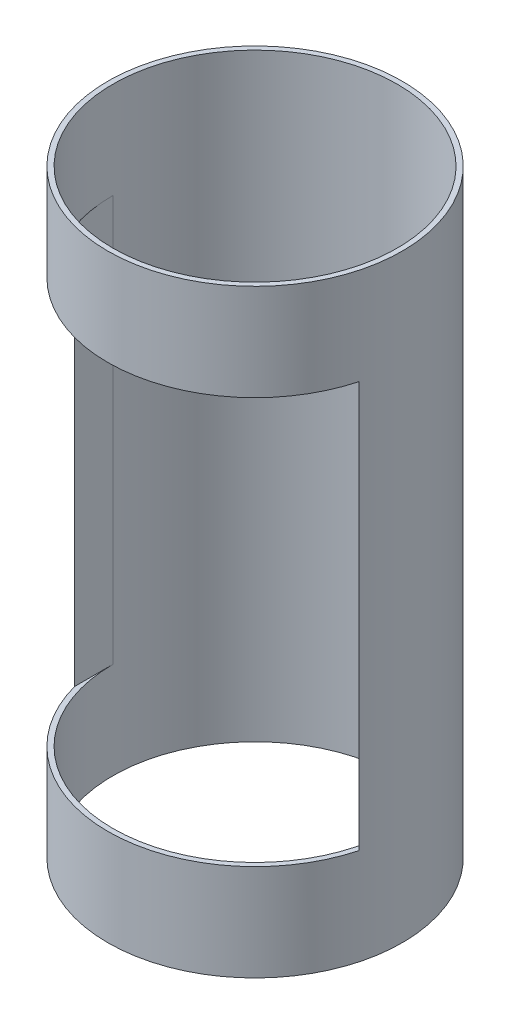
ISO-10303-21;
HEADER;
FILE_DESCRIPTION(('STEP AP214'),'2;1');
FILE_NAME('part.step','',(''),(''),'','','');
FILE_SCHEMA(('AUTOMOTIVE_DESIGN { 1 0 10303 214 1 1 1 1 }'));
ENDSEC;
DATA;
#1=APPLICATION_CONTEXT('core data for automotive mechanical design processes');
#2=APPLICATION_PROTOCOL_DEFINITION('international standard','automotive_design',2000,#1);
#3=PRODUCT_CONTEXT('',#1,'mechanical');
#4=PRODUCT('Part','Part','',(#3));
#5=PRODUCT_RELATED_PRODUCT_CATEGORY('part','',(#4));
#6=PRODUCT_DEFINITION_FORMATION('','',#4);
#7=PRODUCT_DEFINITION_CONTEXT('part definition',#1,'design');
#8=PRODUCT_DEFINITION('design','',#6,#7);
#9=PRODUCT_DEFINITION_SHAPE('','',#8);
#10=(LENGTH_UNIT() NAMED_UNIT(*) SI_UNIT(.MILLI.,.METRE.));
#11=(NAMED_UNIT(*) PLANE_ANGLE_UNIT() SI_UNIT($,.RADIAN.));
#12=(NAMED_UNIT(*) SI_UNIT($,.STERADIAN.) SOLID_ANGLE_UNIT());
#13=UNCERTAINTY_MEASURE_WITH_UNIT(LENGTH_MEASURE(1.E-05),#10,'distance_accuracy_value','');
#14=(GEOMETRIC_REPRESENTATION_CONTEXT(3) GLOBAL_UNCERTAINTY_ASSIGNED_CONTEXT((#13)) GLOBAL_UNIT_ASSIGNED_CONTEXT((#10,
#11,#12)) REPRESENTATION_CONTEXT('',''));
#15=CARTESIAN_POINT('',(0.,0.,0.));
#16=DIRECTION('',(0.,0.,1.));
#17=DIRECTION('',(1.,0.,0.));
#18=AXIS2_PLACEMENT_3D('',#15,#16,#17);
#19=CARTESIAN_POINT('',(0.,374.65,0.));
#20=DIRECTION('',(0.,-1.,0.));
#21=DIRECTION('',(0.,0.,-1.));
#22=AXIS2_PLACEMENT_3D('',#19,#20,#21);
#23=CYLINDRICAL_SURFACE('',#22,92.0749999999999);
#24=CARTESIAN_POINT('',(0.,374.65,0.));
#25=DIRECTION('',(0.,1.,0.));
#26=DIRECTION('',(0.,0.,1.));
#27=AXIS2_PLACEMENT_3D('',#24,#25,#26);
#28=CIRCLE('',#27,92.0749999999999);
#29=CARTESIAN_POINT('',(0.,374.65,92.0749999999999));
#30=VERTEX_POINT('',#29);
#31=EDGE_CURVE('E113',#30,#30,#28,.T.);
#32=ORIENTED_EDGE('',*,*,#31,.F.);
#33=EDGE_LOOP('',(#32));
#34=FACE_BOUND('',#33,.T.);
#35=CARTESIAN_POINT('',(0.,0.,0.));
#36=DIRECTION('',(0.,1.,0.));
#37=DIRECTION('',(0.,0.,1.));
#38=AXIS2_PLACEMENT_3D('',#35,#36,#37);
#39=CIRCLE('',#38,92.0749999999999);
#40=CARTESIAN_POINT('',(0.,0.,92.0749999999999));
#41=VERTEX_POINT('',#40);
#42=EDGE_CURVE('E110',#41,#41,#39,.T.);
#43=ORIENTED_EDGE('',*,*,#42,.T.);
#44=EDGE_LOOP('',(#43));
#45=FACE_BOUND('',#44,.T.);
#46=CARTESIAN_POINT('',(0.,60.325,0.));
#47=DIRECTION('',(0.,1.,0.));
#48=DIRECTION('',(0.,0.,1.));
#49=AXIS2_PLACEMENT_3D('',#46,#47,#48);
#50=CIRCLE('',#49,92.0749999999999);
#51=CARTESIAN_POINT('',(-88.9,60.325,23.9707243319842));
#52=VERTEX_POINT('',#51);
#53=CARTESIAN_POINT('',(88.9,60.325,23.9707243319844));
#54=VERTEX_POINT('',#53);
#55=EDGE_CURVE('E47',#52,#54,#50,.T.);
#56=ORIENTED_EDGE('',*,*,#55,.F.);
#57=DIRECTION('',(0.,-1.,0.));
#58=VECTOR('',#57,1.);
#59=CARTESIAN_POINT('',(-88.9,374.65,23.9707243319842));
#60=LINE('',#59,#58);
#61=CARTESIAN_POINT('',(-88.9,314.325,23.9707243319842));
#62=VERTEX_POINT('',#61);
#63=EDGE_CURVE('E101',#62,#52,#60,.T.);
#64=ORIENTED_EDGE('',*,*,#63,.F.);
#65=CARTESIAN_POINT('',(0.,314.325,0.));
#66=DIRECTION('',(0.,-1.,0.));
#67=DIRECTION('',(0.,0.,-1.));
#68=AXIS2_PLACEMENT_3D('',#65,#66,#67);
#69=CIRCLE('',#68,92.0749999999999);
#70=CARTESIAN_POINT('',(88.9,314.325,23.9707243319844));
#71=VERTEX_POINT('',#70);
#72=EDGE_CURVE('E103',#71,#62,#69,.T.);
#73=ORIENTED_EDGE('',*,*,#72,.F.);
#74=DIRECTION('',(0.,-1.,0.));
#75=VECTOR('',#74,1.);
#76=CARTESIAN_POINT('',(88.9,374.65,23.9707243319844));
#77=LINE('',#76,#75);
#78=EDGE_CURVE('E89',#54,#71,#77,.F.);
#79=ORIENTED_EDGE('',*,*,#78,.F.);
#80=EDGE_LOOP('',(#56,#64,#73,#79));
#81=FACE_BOUND('',#80,.T.);
#82=ADVANCED_FACE('F33',(#34,#45,#81),#23,.T.);
#83=CARTESIAN_POINT('',(0.,374.65,0.));
#84=DIRECTION('',(0.,-1.,0.));
#85=DIRECTION('',(0.,0.,-1.));
#86=AXIS2_PLACEMENT_3D('',#83,#84,#85);
#87=CYLINDRICAL_SURFACE('',#86,88.9000000000002);
#88=CARTESIAN_POINT('',(0.,374.65,0.));
#89=DIRECTION('',(0.,1.,0.));
#90=DIRECTION('',(0.,0.,1.));
#91=AXIS2_PLACEMENT_3D('',#88,#89,#90);
#92=CIRCLE('',#91,88.9000000000002);
#93=CARTESIAN_POINT('',(0.,374.65,88.9000000000002));
#94=VERTEX_POINT('',#93);
#95=EDGE_CURVE('E107',#94,#94,#92,.T.);
#96=ORIENTED_EDGE('',*,*,#95,.T.);
#97=EDGE_LOOP('',(#96));
#98=FACE_BOUND('',#97,.T.);
#99=CARTESIAN_POINT('',(0.,0.,0.));
#100=DIRECTION('',(0.,1.,0.));
#101=DIRECTION('',(0.,0.,1.));
#102=AXIS2_PLACEMENT_3D('',#99,#100,#101);
#103=CIRCLE('',#102,88.9000000000002);
#104=CARTESIAN_POINT('',(0.,0.,88.9000000000002));
#105=VERTEX_POINT('',#104);
#106=EDGE_CURVE('E106',#105,#105,#103,.T.);
#107=ORIENTED_EDGE('',*,*,#106,.F.);
#108=EDGE_LOOP('',(#107));
#109=FACE_BOUND('',#108,.T.);
#110=DIRECTION('',(0.,1.,0.));
#111=VECTOR('',#110,1.);
#112=CARTESIAN_POINT('',(88.9,60.325,0.));
#113=LINE('',#112,#111);
#114=CARTESIAN_POINT('',(88.9,60.325,0.));
#115=VERTEX_POINT('',#114);
#116=CARTESIAN_POINT('',(88.9,314.325,0.));
#117=VERTEX_POINT('',#116);
#118=EDGE_CURVE('E87',#115,#117,#113,.T.);
#119=ORIENTED_EDGE('',*,*,#118,.T.);
#120=CARTESIAN_POINT('',(0.,314.325,0.));
#121=DIRECTION('',(0.,-1.,0.));
#122=DIRECTION('',(0.,0.,-1.));
#123=AXIS2_PLACEMENT_3D('',#120,#121,#122);
#124=CIRCLE('',#123,88.9000000000002);
#125=CARTESIAN_POINT('',(-88.9,314.325,0.));
#126=VERTEX_POINT('',#125);
#127=EDGE_CURVE('E11',#117,#126,#124,.T.);
#128=ORIENTED_EDGE('',*,*,#127,.T.);
#129=DIRECTION('',(0.,-1.,0.));
#130=VECTOR('',#129,1.);
#131=CARTESIAN_POINT('',(-88.9,60.325,0.));
#132=LINE('',#131,#130);
#133=CARTESIAN_POINT('',(-88.9000000000002,60.325,0.));
#134=VERTEX_POINT('',#133);
#135=EDGE_CURVE('E92',#126,#134,#132,.T.);
#136=ORIENTED_EDGE('',*,*,#135,.T.);
#137=CARTESIAN_POINT('',(0.,60.325,0.));
#138=DIRECTION('',(0.,1.,0.));
#139=DIRECTION('',(0.,0.,1.));
#140=AXIS2_PLACEMENT_3D('',#137,#138,#139);
#141=CIRCLE('',#140,88.9000000000002);
#142=EDGE_CURVE('E40',#134,#115,#141,.T.);
#143=ORIENTED_EDGE('',*,*,#142,.T.);
#144=EDGE_LOOP('',(#119,#128,#136,#143));
#145=FACE_BOUND('',#144,.T.);
#146=ADVANCED_FACE('F91',(#98,#109,#145),#87,.F.);
#147=CARTESIAN_POINT('',(0.,374.65,0.));
#148=DIRECTION('',(0.,1.,0.));
#149=DIRECTION('',(0.,0.,1.));
#150=AXIS2_PLACEMENT_3D('',#147,#148,#149);
#151=PLANE('',#150);
#152=ORIENTED_EDGE('',*,*,#31,.T.);
#153=EDGE_LOOP('',(#152));
#154=FACE_BOUND('',#153,.T.);
#155=ORIENTED_EDGE('',*,*,#95,.F.);
#156=EDGE_LOOP('',(#155));
#157=FACE_BOUND('',#156,.T.);
#158=ADVANCED_FACE('F123',(#154,#157),#151,.T.);
#159=CARTESIAN_POINT('',(0.,0.,0.));
#160=DIRECTION('',(0.,1.,0.));
#161=DIRECTION('',(0.,0.,1.));
#162=AXIS2_PLACEMENT_3D('',#159,#160,#161);
#163=PLANE('',#162);
#164=ORIENTED_EDGE('',*,*,#42,.F.);
#165=EDGE_LOOP('',(#164));
#166=FACE_BOUND('',#165,.T.);
#167=ORIENTED_EDGE('',*,*,#106,.T.);
#168=EDGE_LOOP('',(#167));
#169=FACE_BOUND('',#168,.T.);
#170=ADVANCED_FACE('F120',(#166,#169),#163,.F.);
#171=CARTESIAN_POINT('',(88.9,60.325,92.0749999999999));
#172=DIRECTION('',(-1.,0.,0.));
#173=DIRECTION('',(0.,0.,1.));
#174=AXIS2_PLACEMENT_3D('',#171,#172,#173);
#175=PLANE('',#174);
#176=ORIENTED_EDGE('',*,*,#78,.T.);
#177=DIRECTION('',(0.,0.,-1.));
#178=VECTOR('',#177,1.);
#179=CARTESIAN_POINT('',(88.9,314.325,92.0749999999999));
#180=LINE('',#179,#178);
#181=EDGE_CURVE('E76',#71,#117,#180,.T.);
#182=ORIENTED_EDGE('',*,*,#181,.T.);
#183=ORIENTED_EDGE('',*,*,#118,.F.);
#184=DIRECTION('',(0.,0.,-1.));
#185=VECTOR('',#184,1.);
#186=CARTESIAN_POINT('',(88.9,60.325,92.0749999999999));
#187=LINE('',#186,#185);
#188=EDGE_CURVE('E94',#54,#115,#187,.T.);
#189=ORIENTED_EDGE('',*,*,#188,.F.);
#190=EDGE_LOOP('',(#176,#182,#183,#189));
#191=FACE_BOUND('',#190,.T.);
#192=ADVANCED_FACE('F85',(#191),#175,.T.);
#193=CARTESIAN_POINT('',(-88.9,314.325,92.0749999999999));
#194=DIRECTION('',(0.,-1.,0.));
#195=DIRECTION('',(0.,0.,-1.));
#196=AXIS2_PLACEMENT_3D('',#193,#194,#195);
#197=PLANE('',#196);
#198=ORIENTED_EDGE('',*,*,#72,.T.);
#199=DIRECTION('',(0.,0.,-1.));
#200=VECTOR('',#199,1.);
#201=CARTESIAN_POINT('',(-88.9,314.325,92.0749999999999));
#202=LINE('',#201,#200);
#203=EDGE_CURVE('E79',#62,#126,#202,.T.);
#204=ORIENTED_EDGE('',*,*,#203,.T.);
#205=ORIENTED_EDGE('',*,*,#127,.F.);
#206=ORIENTED_EDGE('',*,*,#181,.F.);
#207=EDGE_LOOP('',(#198,#204,#205,#206));
#208=FACE_BOUND('',#207,.T.);
#209=ADVANCED_FACE('F75',(#208),#197,.T.);
#210=CARTESIAN_POINT('',(-88.9,60.325,92.0749999999999));
#211=DIRECTION('',(1.,0.,0.));
#212=DIRECTION('',(0.,0.,-1.));
#213=AXIS2_PLACEMENT_3D('',#210,#211,#212);
#214=PLANE('',#213);
#215=ORIENTED_EDGE('',*,*,#63,.T.);
#216=DIRECTION('',(0.,0.,-1.));
#217=VECTOR('',#216,1.);
#218=CARTESIAN_POINT('',(-88.9,60.325,92.0749999999999));
#219=LINE('',#218,#217);
#220=EDGE_CURVE('E54',#52,#134,#219,.T.);
#221=ORIENTED_EDGE('',*,*,#220,.T.);
#222=ORIENTED_EDGE('',*,*,#135,.F.);
#223=ORIENTED_EDGE('',*,*,#203,.F.);
#224=EDGE_LOOP('',(#215,#221,#222,#223));
#225=FACE_BOUND('',#224,.T.);
#226=ADVANCED_FACE('F141',(#225),#214,.T.);
#227=CARTESIAN_POINT('',(-88.9,60.325,92.0749999999999));
#228=DIRECTION('',(0.,1.,0.));
#229=DIRECTION('',(0.,0.,1.));
#230=AXIS2_PLACEMENT_3D('',#227,#228,#229);
#231=PLANE('',#230);
#232=ORIENTED_EDGE('',*,*,#55,.T.);
#233=ORIENTED_EDGE('',*,*,#188,.T.);
#234=ORIENTED_EDGE('',*,*,#142,.F.);
#235=ORIENTED_EDGE('',*,*,#220,.F.);
#236=EDGE_LOOP('',(#232,#233,#234,#235));
#237=FACE_BOUND('',#236,.T.);
#238=ADVANCED_FACE('F144',(#237),#231,.T.);
#239=CLOSED_SHELL('',(#82,#146,#158,#170,#192,#209,#226,#238));
#240=MANIFOLD_SOLID_BREP('B2',#239);
#241=ADVANCED_BREP_SHAPE_REPRESENTATION('',(#18,#240),#14);
#242=SHAPE_DEFINITION_REPRESENTATION(#9,#241);
ENDSEC;
END-ISO-10303-21;
